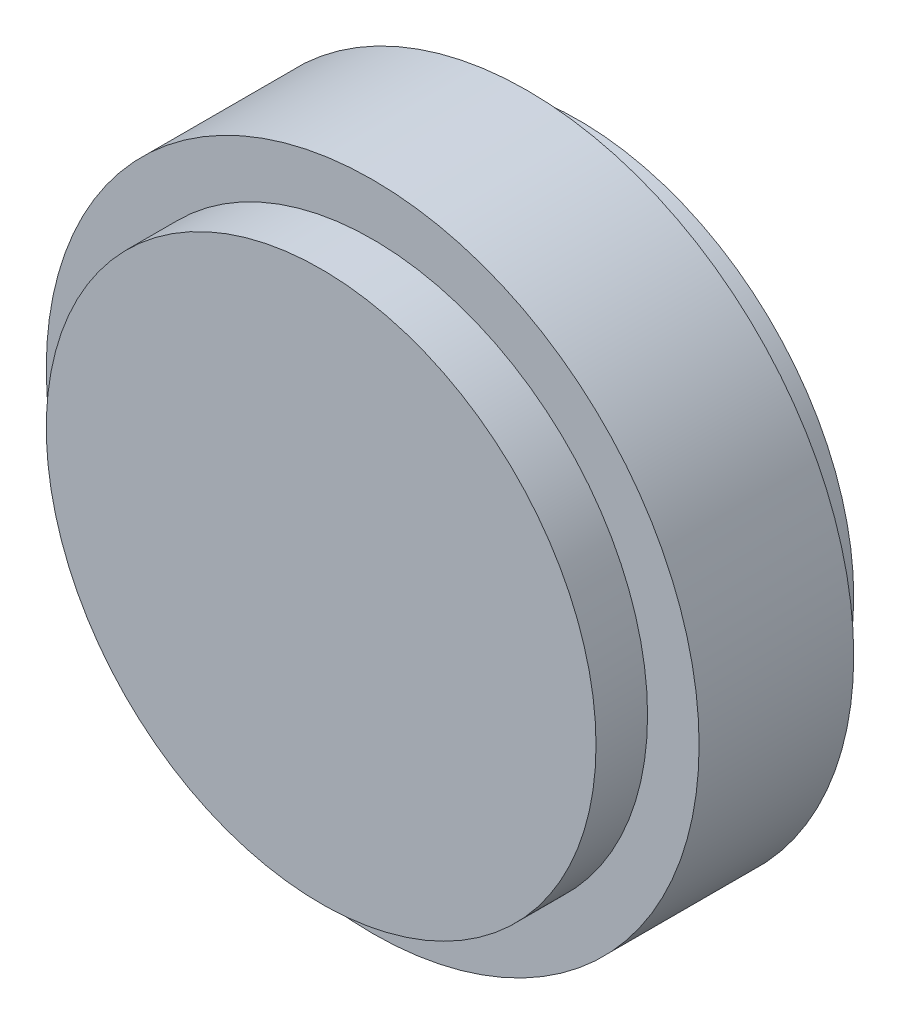
ISO-10303-21;
HEADER;
FILE_DESCRIPTION(('STEP AP214'),'2;1');
FILE_NAME('part.step','',(''),(''),'','','');
FILE_SCHEMA(('AUTOMOTIVE_DESIGN { 1 0 10303 214 1 1 1 1 }'));
ENDSEC;
DATA;
#1=APPLICATION_CONTEXT('core data for automotive mechanical design processes');
#2=APPLICATION_PROTOCOL_DEFINITION('international standard','automotive_design',2000,#1);
#3=PRODUCT_CONTEXT('',#1,'mechanical');
#4=PRODUCT('Part','Part','',(#3));
#5=PRODUCT_RELATED_PRODUCT_CATEGORY('part','',(#4));
#6=PRODUCT_DEFINITION_FORMATION('','',#4);
#7=PRODUCT_DEFINITION_CONTEXT('part definition',#1,'design');
#8=PRODUCT_DEFINITION('design','',#6,#7);
#9=PRODUCT_DEFINITION_SHAPE('','',#8);
#10=(LENGTH_UNIT() NAMED_UNIT(*) SI_UNIT(.MILLI.,.METRE.));
#11=(NAMED_UNIT(*) PLANE_ANGLE_UNIT() SI_UNIT($,.RADIAN.));
#12=(NAMED_UNIT(*) SI_UNIT($,.STERADIAN.) SOLID_ANGLE_UNIT());
#13=UNCERTAINTY_MEASURE_WITH_UNIT(LENGTH_MEASURE(1.E-05),#10,'distance_accuracy_value','');
#14=(GEOMETRIC_REPRESENTATION_CONTEXT(3) GLOBAL_UNCERTAINTY_ASSIGNED_CONTEXT((#13)) GLOBAL_UNIT_ASSIGNED_CONTEXT((#10,
#11,#12)) REPRESENTATION_CONTEXT('',''));
#15=CARTESIAN_POINT('',(0.,0.,0.));
#16=DIRECTION('',(0.,0.,1.));
#17=DIRECTION('',(1.,0.,0.));
#18=AXIS2_PLACEMENT_3D('',#15,#16,#17);
#19=CARTESIAN_POINT('',(0.,0.,0.));
#20=DIRECTION('',(0.,0.,-1.));
#21=DIRECTION('',(-1.,0.,0.));
#22=AXIS2_PLACEMENT_3D('',#19,#20,#21);
#23=PLANE('',#22);
#24=CARTESIAN_POINT('',(0.,0.,0.));
#25=DIRECTION('',(0.,0.,1.));
#26=DIRECTION('',(1.,0.,0.));
#27=AXIS2_PLACEMENT_3D('',#24,#25,#26);
#28=CIRCLE('',#27,16.);
#29=CARTESIAN_POINT('',(16.,0.,0.));
#30=VERTEX_POINT('',#29);
#31=EDGE_CURVE('E10',#30,#30,#28,.T.);
#32=ORIENTED_EDGE('',*,*,#31,.T.);
#33=EDGE_LOOP('',(#32));
#34=FACE_BOUND('',#33,.T.);
#35=ADVANCED_FACE('F34',(#34),#23,.F.);
#36=CARTESIAN_POINT('',(0.,0.,0.));
#37=DIRECTION('',(0.,0.,1.));
#38=DIRECTION('',(1.,0.,0.));
#39=AXIS2_PLACEMENT_3D('',#36,#37,#38);
#40=CYLINDRICAL_SURFACE('',#39,16.);
#41=ORIENTED_EDGE('',*,*,#31,.F.);
#42=EDGE_LOOP('',(#41));
#43=FACE_BOUND('',#42,.T.);
#44=CARTESIAN_POINT('',(0.,0.,-3.));
#45=DIRECTION('',(0.,0.,1.));
#46=DIRECTION('',(1.,0.,0.));
#47=AXIS2_PLACEMENT_3D('',#44,#45,#46);
#48=CIRCLE('',#47,16.);
#49=CARTESIAN_POINT('',(16.,0.,-3.));
#50=VERTEX_POINT('',#49);
#51=EDGE_CURVE('E40',#50,#50,#48,.T.);
#52=ORIENTED_EDGE('',*,*,#51,.T.);
#53=EDGE_LOOP('',(#52));
#54=FACE_BOUND('',#53,.T.);
#55=ADVANCED_FACE('F72',(#43,#54),#40,.T.);
#56=CARTESIAN_POINT('',(0.,16.,-3.));
#57=DIRECTION('',(0.,0.,-1.));
#58=DIRECTION('',(-1.,0.,0.));
#59=AXIS2_PLACEMENT_3D('',#56,#57,#58);
#60=PLANE('',#59);
#61=ORIENTED_EDGE('',*,*,#51,.F.);
#62=EDGE_LOOP('',(#61));
#63=FACE_BOUND('',#62,.T.);
#64=CARTESIAN_POINT('',(0.,0.,-3.));
#65=DIRECTION('',(0.,0.,1.));
#66=DIRECTION('',(1.,0.,0.));
#67=AXIS2_PLACEMENT_3D('',#64,#65,#66);
#68=CIRCLE('',#67,19.);
#69=CARTESIAN_POINT('',(19.,0.,-3.));
#70=VERTEX_POINT('',#69);
#71=EDGE_CURVE('E44',#70,#70,#68,.T.);
#72=ORIENTED_EDGE('',*,*,#71,.T.);
#73=EDGE_LOOP('',(#72));
#74=FACE_BOUND('',#73,.T.);
#75=ADVANCED_FACE('F76',(#63,#74),#60,.F.);
#76=CARTESIAN_POINT('',(0.,0.,0.));
#77=DIRECTION('',(0.,0.,1.));
#78=DIRECTION('',(1.,0.,0.));
#79=AXIS2_PLACEMENT_3D('',#76,#77,#78);
#80=CYLINDRICAL_SURFACE('',#79,19.);
#81=ORIENTED_EDGE('',*,*,#71,.F.);
#82=EDGE_LOOP('',(#81));
#83=FACE_BOUND('',#82,.T.);
#84=CARTESIAN_POINT('',(0.,0.,-12.));
#85=DIRECTION('',(0.,0.,1.));
#86=DIRECTION('',(1.,0.,0.));
#87=AXIS2_PLACEMENT_3D('',#84,#85,#86);
#88=CIRCLE('',#87,19.);
#89=CARTESIAN_POINT('',(19.,0.,-12.));
#90=VERTEX_POINT('',#89);
#91=EDGE_CURVE('E48',#90,#90,#88,.T.);
#92=ORIENTED_EDGE('',*,*,#91,.T.);
#93=EDGE_LOOP('',(#92));
#94=FACE_BOUND('',#93,.T.);
#95=ADVANCED_FACE('F81',(#83,#94),#80,.T.);
#96=CARTESIAN_POINT('',(0.,16.,-12.));
#97=DIRECTION('',(0.,0.,1.));
#98=DIRECTION('',(1.,0.,0.));
#99=AXIS2_PLACEMENT_3D('',#96,#97,#98);
#100=PLANE('',#99);
#101=ORIENTED_EDGE('',*,*,#91,.F.);
#102=EDGE_LOOP('',(#101));
#103=FACE_BOUND('',#102,.T.);
#104=CARTESIAN_POINT('',(0.,0.,-12.));
#105=DIRECTION('',(0.,0.,1.));
#106=DIRECTION('',(1.,0.,0.));
#107=AXIS2_PLACEMENT_3D('',#104,#105,#106);
#108=CIRCLE('',#107,16.);
#109=CARTESIAN_POINT('',(16.,0.,-12.));
#110=VERTEX_POINT('',#109);
#111=EDGE_CURVE('E53',#110,#110,#108,.T.);
#112=ORIENTED_EDGE('',*,*,#111,.T.);
#113=EDGE_LOOP('',(#112));
#114=FACE_BOUND('',#113,.T.);
#115=ADVANCED_FACE('F68',(#103,#114),#100,.F.);
#116=CARTESIAN_POINT('',(0.,0.,0.));
#117=DIRECTION('',(0.,0.,1.));
#118=DIRECTION('',(1.,0.,0.));
#119=AXIS2_PLACEMENT_3D('',#116,#117,#118);
#120=CYLINDRICAL_SURFACE('',#119,16.);
#121=ORIENTED_EDGE('',*,*,#111,.F.);
#122=EDGE_LOOP('',(#121));
#123=FACE_BOUND('',#122,.T.);
#124=CARTESIAN_POINT('',(0.,0.,-15.));
#125=DIRECTION('',(0.,0.,1.));
#126=DIRECTION('',(1.,0.,0.));
#127=AXIS2_PLACEMENT_3D('',#124,#125,#126);
#128=CIRCLE('',#127,16.);
#129=CARTESIAN_POINT('',(16.,0.,-15.));
#130=VERTEX_POINT('',#129);
#131=EDGE_CURVE('E56',#130,#130,#128,.T.);
#132=ORIENTED_EDGE('',*,*,#131,.T.);
#133=EDGE_LOOP('',(#132));
#134=FACE_BOUND('',#133,.T.);
#135=ADVANCED_FACE('F60',(#123,#134),#120,.T.);
#136=CARTESIAN_POINT('',(0.,0.,-15.));
#137=DIRECTION('',(0.,0.,1.));
#138=DIRECTION('',(1.,0.,0.));
#139=AXIS2_PLACEMENT_3D('',#136,#137,#138);
#140=PLANE('',#139);
#141=ORIENTED_EDGE('',*,*,#131,.F.);
#142=EDGE_LOOP('',(#141));
#143=FACE_BOUND('',#142,.T.);
#144=ADVANCED_FACE('F62',(#143),#140,.F.);
#145=CLOSED_SHELL('',(#35,#55,#75,#95,#115,#135,#144));
#146=MANIFOLD_SOLID_BREP('B2',#145);
#147=ADVANCED_BREP_SHAPE_REPRESENTATION('',(#18,#146),#14);
#148=SHAPE_DEFINITION_REPRESENTATION(#9,#147);
ENDSEC;
END-ISO-10303-21;
